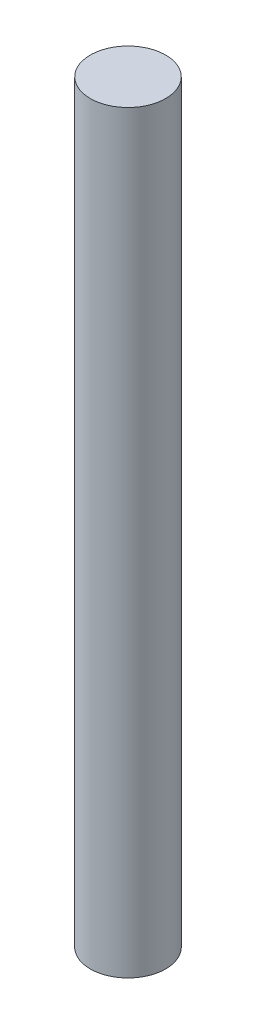
ISO-10303-21;
HEADER;
FILE_DESCRIPTION(('STEP AP214'),'2;1');
FILE_NAME('part.step','',(''),(''),'','','');
FILE_SCHEMA(('AUTOMOTIVE_DESIGN { 1 0 10303 214 1 1 1 1 }'));
ENDSEC;
DATA;
#1=APPLICATION_CONTEXT('core data for automotive mechanical design processes');
#2=APPLICATION_PROTOCOL_DEFINITION('international standard','automotive_design',2000,#1);
#3=PRODUCT_CONTEXT('',#1,'mechanical');
#4=PRODUCT('Part','Part','',(#3));
#5=PRODUCT_RELATED_PRODUCT_CATEGORY('part','',(#4));
#6=PRODUCT_DEFINITION_FORMATION('','',#4);
#7=PRODUCT_DEFINITION_CONTEXT('part definition',#1,'design');
#8=PRODUCT_DEFINITION('design','',#6,#7);
#9=PRODUCT_DEFINITION_SHAPE('','',#8);
#10=(LENGTH_UNIT() NAMED_UNIT(*) SI_UNIT(.MILLI.,.METRE.));
#11=(NAMED_UNIT(*) PLANE_ANGLE_UNIT() SI_UNIT($,.RADIAN.));
#12=(NAMED_UNIT(*) SI_UNIT($,.STERADIAN.) SOLID_ANGLE_UNIT());
#13=UNCERTAINTY_MEASURE_WITH_UNIT(LENGTH_MEASURE(1.E-05),#10,'distance_accuracy_value','');
#14=(GEOMETRIC_REPRESENTATION_CONTEXT(3) GLOBAL_UNCERTAINTY_ASSIGNED_CONTEXT((#13)) GLOBAL_UNIT_ASSIGNED_CONTEXT((#10,
#11,#12)) REPRESENTATION_CONTEXT('',''));
#15=CARTESIAN_POINT('',(0.,0.,0.));
#16=DIRECTION('',(0.,0.,1.));
#17=DIRECTION('',(1.,0.,0.));
#18=AXIS2_PLACEMENT_3D('',#15,#16,#17);
#19=CARTESIAN_POINT('',(-3.34782608695652,50.,-1.92391304347826));
#20=DIRECTION('',(0.,-1.,0.));
#21=DIRECTION('',(0.,0.,-1.));
#22=AXIS2_PLACEMENT_3D('',#19,#20,#21);
#23=CYLINDRICAL_SURFACE('',#22,2.5);
#24=CARTESIAN_POINT('',(-3.34782608695652,50.,-1.92391304347826));
#25=DIRECTION('',(0.,1.,0.));
#26=DIRECTION('',(0.,0.,1.));
#27=AXIS2_PLACEMENT_3D('',#24,#25,#26);
#28=CIRCLE('',#27,2.5);
#29=CARTESIAN_POINT('',(-3.34782608695652,50.,0.576086956521742));
#30=VERTEX_POINT('',#29);
#31=EDGE_CURVE('E10',#30,#30,#28,.T.);
#32=ORIENTED_EDGE('',*,*,#31,.F.);
#33=EDGE_LOOP('',(#32));
#34=FACE_BOUND('',#33,.T.);
#35=CARTESIAN_POINT('',(-3.34782608695652,0.,-1.92391304347826));
#36=DIRECTION('',(0.,1.,0.));
#37=DIRECTION('',(0.,0.,1.));
#38=AXIS2_PLACEMENT_3D('',#35,#36,#37);
#39=CIRCLE('',#38,2.5);
#40=CARTESIAN_POINT('',(-3.34782608695652,0.,0.576086956521742));
#41=VERTEX_POINT('',#40);
#42=EDGE_CURVE('E46',#41,#41,#39,.T.);
#43=ORIENTED_EDGE('',*,*,#42,.T.);
#44=EDGE_LOOP('',(#43));
#45=FACE_BOUND('',#44,.T.);
#46=ADVANCED_FACE('F43',(#34,#45),#23,.T.);
#47=CARTESIAN_POINT('',(-3.34782608695652,50.,-1.92391304347826));
#48=DIRECTION('',(0.,1.,0.));
#49=DIRECTION('',(0.,0.,1.));
#50=AXIS2_PLACEMENT_3D('',#47,#48,#49);
#51=PLANE('',#50);
#52=ORIENTED_EDGE('',*,*,#31,.T.);
#53=EDGE_LOOP('',(#52));
#54=FACE_BOUND('',#53,.T.);
#55=ADVANCED_FACE('F60',(#54),#51,.T.);
#56=CARTESIAN_POINT('',(-3.34782608695652,0.,-1.92391304347826));
#57=DIRECTION('',(0.,1.,0.));
#58=DIRECTION('',(0.,0.,1.));
#59=AXIS2_PLACEMENT_3D('',#56,#57,#58);
#60=PLANE('',#59);
#61=ORIENTED_EDGE('',*,*,#42,.F.);
#62=EDGE_LOOP('',(#61));
#63=FACE_BOUND('',#62,.T.);
#64=ADVANCED_FACE('F58',(#63),#60,.F.);
#65=CLOSED_SHELL('',(#46,#55,#64));
#66=MANIFOLD_SOLID_BREP('B2',#65);
#67=ADVANCED_BREP_SHAPE_REPRESENTATION('',(#18,#66),#14);
#68=SHAPE_DEFINITION_REPRESENTATION(#9,#67);
ENDSEC;
END-ISO-10303-21;
